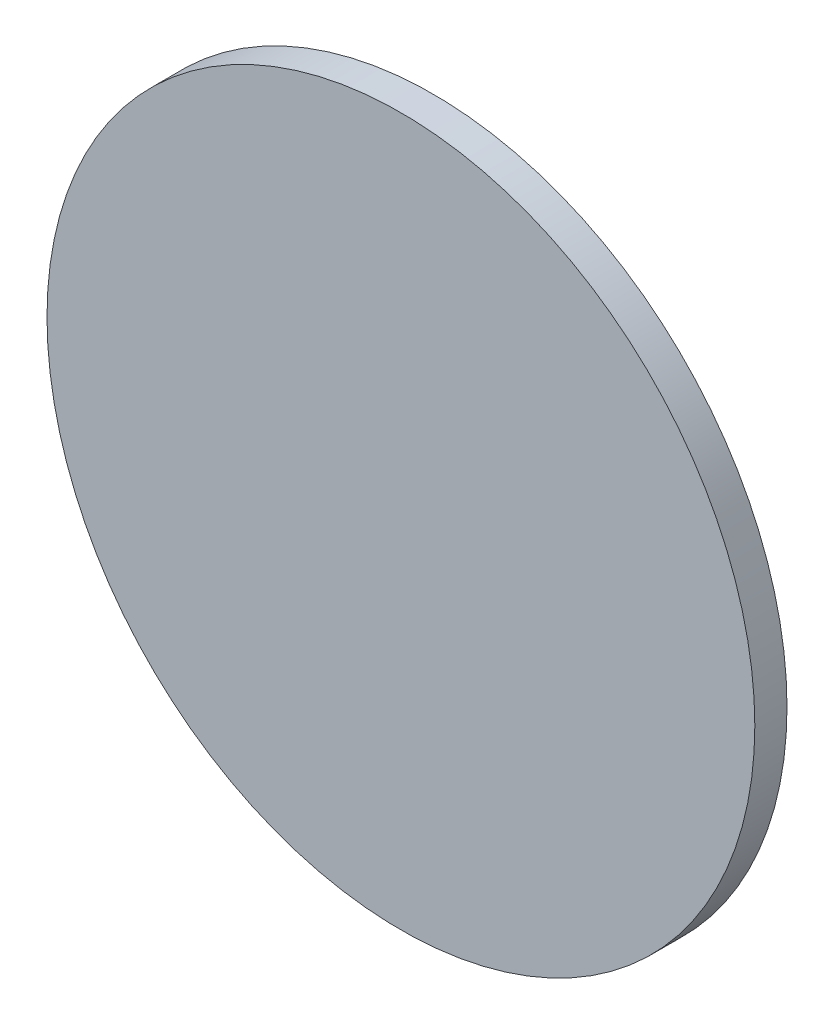
ISO-10303-21;
HEADER;
FILE_DESCRIPTION(('STEP AP214'),'2;1');
FILE_NAME('part.step','',(''),(''),'','','');
FILE_SCHEMA(('AUTOMOTIVE_DESIGN { 1 0 10303 214 1 1 1 1 }'));
ENDSEC;
DATA;
#1=APPLICATION_CONTEXT('core data for automotive mechanical design processes');
#2=APPLICATION_PROTOCOL_DEFINITION('international standard','automotive_design',2000,#1);
#3=PRODUCT_CONTEXT('',#1,'mechanical');
#4=PRODUCT('Part','Part','',(#3));
#5=PRODUCT_RELATED_PRODUCT_CATEGORY('part','',(#4));
#6=PRODUCT_DEFINITION_FORMATION('','',#4);
#7=PRODUCT_DEFINITION_CONTEXT('part definition',#1,'design');
#8=PRODUCT_DEFINITION('design','',#6,#7);
#9=PRODUCT_DEFINITION_SHAPE('','',#8);
#10=(LENGTH_UNIT() NAMED_UNIT(*) SI_UNIT(.MILLI.,.METRE.));
#11=(NAMED_UNIT(*) PLANE_ANGLE_UNIT() SI_UNIT($,.RADIAN.));
#12=(NAMED_UNIT(*) SI_UNIT($,.STERADIAN.) SOLID_ANGLE_UNIT());
#13=UNCERTAINTY_MEASURE_WITH_UNIT(LENGTH_MEASURE(1.E-05),#10,'distance_accuracy_value','');
#14=(GEOMETRIC_REPRESENTATION_CONTEXT(3) GLOBAL_UNCERTAINTY_ASSIGNED_CONTEXT((#13)) GLOBAL_UNIT_ASSIGNED_CONTEXT((#10,
#11,#12)) REPRESENTATION_CONTEXT('',''));
#15=CARTESIAN_POINT('',(0.,0.,0.));
#16=DIRECTION('',(0.,0.,1.));
#17=DIRECTION('',(1.,0.,0.));
#18=AXIS2_PLACEMENT_3D('',#15,#16,#17);
#19=CARTESIAN_POINT('',(0.,0.,-12.7));
#20=DIRECTION('',(0.,0.,1.));
#21=DIRECTION('',(1.,0.,0.));
#22=AXIS2_PLACEMENT_3D('',#19,#20,#21);
#23=CYLINDRICAL_SURFACE('',#22,139.7);
#24=CARTESIAN_POINT('',(0.,0.,-12.7));
#25=DIRECTION('',(0.,0.,1.));
#26=DIRECTION('',(1.,0.,0.));
#27=AXIS2_PLACEMENT_3D('',#24,#25,#26);
#28=CIRCLE('',#27,139.7);
#29=CARTESIAN_POINT('',(139.7,0.,-12.7));
#30=VERTEX_POINT('',#29);
#31=EDGE_CURVE('E10',#30,#30,#28,.T.);
#32=ORIENTED_EDGE('',*,*,#31,.T.);
#33=EDGE_LOOP('',(#32));
#34=FACE_BOUND('',#33,.T.);
#35=CARTESIAN_POINT('',(0.,0.,0.));
#36=DIRECTION('',(0.,0.,1.));
#37=DIRECTION('',(1.,0.,0.));
#38=AXIS2_PLACEMENT_3D('',#35,#36,#37);
#39=CIRCLE('',#38,139.7);
#40=CARTESIAN_POINT('',(139.7,0.,0.));
#41=VERTEX_POINT('',#40);
#42=EDGE_CURVE('E46',#41,#41,#39,.T.);
#43=ORIENTED_EDGE('',*,*,#42,.F.);
#44=EDGE_LOOP('',(#43));
#45=FACE_BOUND('',#44,.T.);
#46=ADVANCED_FACE('F43',(#34,#45),#23,.T.);
#47=CARTESIAN_POINT('',(0.,0.,-12.7));
#48=DIRECTION('',(0.,0.,1.));
#49=DIRECTION('',(1.,0.,0.));
#50=AXIS2_PLACEMENT_3D('',#47,#48,#49);
#51=PLANE('',#50);
#52=ORIENTED_EDGE('',*,*,#31,.F.);
#53=EDGE_LOOP('',(#52));
#54=FACE_BOUND('',#53,.T.);
#55=ADVANCED_FACE('F60',(#54),#51,.F.);
#56=CARTESIAN_POINT('',(0.,0.,0.));
#57=DIRECTION('',(0.,0.,1.));
#58=DIRECTION('',(1.,0.,0.));
#59=AXIS2_PLACEMENT_3D('',#56,#57,#58);
#60=PLANE('',#59);
#61=ORIENTED_EDGE('',*,*,#42,.T.);
#62=EDGE_LOOP('',(#61));
#63=FACE_BOUND('',#62,.T.);
#64=ADVANCED_FACE('F57',(#63),#60,.T.);
#65=CLOSED_SHELL('',(#46,#55,#64));
#66=MANIFOLD_SOLID_BREP('B2',#65);
#67=ADVANCED_BREP_SHAPE_REPRESENTATION('',(#18,#66),#14);
#68=SHAPE_DEFINITION_REPRESENTATION(#9,#67);
ENDSEC;
END-ISO-10303-21;
